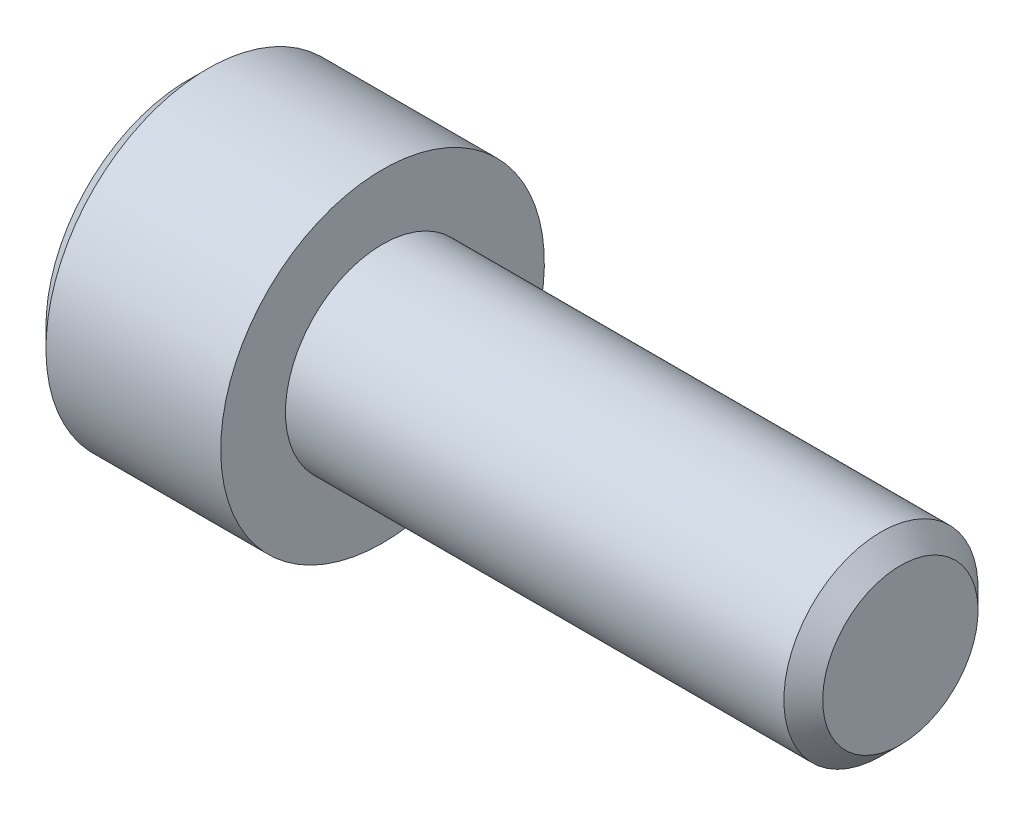
ISO-10303-21;
HEADER;
FILE_DESCRIPTION(('STEP AP214'),'2;1');
FILE_NAME('part.step','',(''),(''),'','','');
FILE_SCHEMA(('AUTOMOTIVE_DESIGN { 1 0 10303 214 1 1 1 1 }'));
ENDSEC;
DATA;
#1=APPLICATION_CONTEXT('core data for automotive mechanical design processes');
#2=APPLICATION_PROTOCOL_DEFINITION('international standard','automotive_design',2000,#1);
#3=PRODUCT_CONTEXT('',#1,'mechanical');
#4=PRODUCT('Part','Part','',(#3));
#5=PRODUCT_RELATED_PRODUCT_CATEGORY('part','',(#4));
#6=PRODUCT_DEFINITION_FORMATION('','',#4);
#7=PRODUCT_DEFINITION_CONTEXT('part definition',#1,'design');
#8=PRODUCT_DEFINITION('design','',#6,#7);
#9=PRODUCT_DEFINITION_SHAPE('','',#8);
#10=(LENGTH_UNIT() NAMED_UNIT(*) SI_UNIT(.MILLI.,.METRE.));
#11=(NAMED_UNIT(*) PLANE_ANGLE_UNIT() SI_UNIT($,.RADIAN.));
#12=(NAMED_UNIT(*) SI_UNIT($,.STERADIAN.) SOLID_ANGLE_UNIT());
#13=UNCERTAINTY_MEASURE_WITH_UNIT(LENGTH_MEASURE(1.E-05),#10,'distance_accuracy_value','');
#14=(GEOMETRIC_REPRESENTATION_CONTEXT(3) GLOBAL_UNCERTAINTY_ASSIGNED_CONTEXT((#13)) GLOBAL_UNIT_ASSIGNED_CONTEXT((#10,
#11,#12)) REPRESENTATION_CONTEXT('',''));
#15=CARTESIAN_POINT('',(0.,0.,0.));
#16=DIRECTION('',(0.,0.,1.));
#17=DIRECTION('',(1.,0.,0.));
#18=AXIS2_PLACEMENT_3D('',#15,#16,#17);
#19=CARTESIAN_POINT('',(-6.,0.,0.));
#20=DIRECTION('',(1.,0.,0.));
#21=DIRECTION('',(0.,1.,0.));
#22=AXIS2_PLACEMENT_3D('',#19,#20,#21);
#23=PLANE('',#22);
#24=CARTESIAN_POINT('',(-6.,0.,0.));
#25=DIRECTION('',(-1.,0.,0.));
#26=DIRECTION('',(0.,-1.,0.));
#27=AXIS2_PLACEMENT_3D('',#24,#25,#26);
#28=CIRCLE('',#27,4.4);
#29=CARTESIAN_POINT('',(-6.,-4.4,0.));
#30=VERTEX_POINT('',#29);
#31=EDGE_CURVE('E156',#30,#30,#28,.T.);
#32=ORIENTED_EDGE('',*,*,#31,.T.);
#33=EDGE_LOOP('',(#32));
#34=FACE_BOUND('',#33,.T.);
#35=DIRECTION('',(0.,-0.499999999999983,-0.866025403784448));
#36=VECTOR('',#35,1.);
#37=CARTESIAN_POINT('',(-6.,-1.4433756729741,2.5));
#38=LINE('',#37,#36);
#39=CARTESIAN_POINT('',(-6.,-1.4433756729741,2.5));
#40=VERTEX_POINT('',#39);
#41=CARTESIAN_POINT('',(-6.,-2.8867513459481,0.));
#42=VERTEX_POINT('',#41);
#43=EDGE_CURVE('E272',#40,#42,#38,.T.);
#44=ORIENTED_EDGE('',*,*,#43,.T.);
#45=DIRECTION('',(0.,0.499999999999983,-0.866025403784448));
#46=VECTOR('',#45,1.);
#47=CARTESIAN_POINT('',(-6.,-2.8867513459481,0.));
#48=LINE('',#47,#46);
#49=CARTESIAN_POINT('',(-6.,-1.4433756729741,-2.5));
#50=VERTEX_POINT('',#49);
#51=EDGE_CURVE('E274',#42,#50,#48,.T.);
#52=ORIENTED_EDGE('',*,*,#51,.T.);
#53=DIRECTION('',(0.,1.,0.));
#54=VECTOR('',#53,1.);
#55=CARTESIAN_POINT('',(-6.,-1.4433756729741,-2.5));
#56=LINE('',#55,#54);
#57=CARTESIAN_POINT('',(-6.,1.4433756729741,-2.5));
#58=VERTEX_POINT('',#57);
#59=EDGE_CURVE('E276',#50,#58,#56,.T.);
#60=ORIENTED_EDGE('',*,*,#59,.T.);
#61=DIRECTION('',(0.,0.499999999999983,0.866025403784448));
#62=VECTOR('',#61,1.);
#63=CARTESIAN_POINT('',(-6.,1.4433756729741,-2.5));
#64=LINE('',#63,#62);
#65=CARTESIAN_POINT('',(-6.,2.8867513459481,0.));
#66=VERTEX_POINT('',#65);
#67=EDGE_CURVE('E121',#58,#66,#64,.T.);
#68=ORIENTED_EDGE('',*,*,#67,.T.);
#69=DIRECTION('',(0.,-0.499999999999983,0.866025403784448));
#70=VECTOR('',#69,1.);
#71=CARTESIAN_POINT('',(-6.,2.8867513459481,0.));
#72=LINE('',#71,#70);
#73=CARTESIAN_POINT('',(-6.,1.4433756729741,2.5));
#74=VERTEX_POINT('',#73);
#75=EDGE_CURVE('E269',#66,#74,#72,.T.);
#76=ORIENTED_EDGE('',*,*,#75,.T.);
#77=DIRECTION('',(0.,-1.,0.));
#78=VECTOR('',#77,1.);
#79=CARTESIAN_POINT('',(-6.,1.4433756729741,2.5));
#80=LINE('',#79,#78);
#81=EDGE_CURVE('E136',#74,#40,#80,.T.);
#82=ORIENTED_EDGE('',*,*,#81,.T.);
#83=EDGE_LOOP('',(#44,#52,#60,#68,#76,#82));
#84=FACE_BOUND('',#83,.T.);
#85=ADVANCED_FACE('F37',(#34,#84),#23,.F.);
#86=CARTESIAN_POINT('',(-5.4,0.,0.));
#87=DIRECTION('',(1.,0.,0.));
#88=DIRECTION('',(0.,1.,0.));
#89=AXIS2_PLACEMENT_3D('',#86,#87,#88);
#90=CONICAL_SURFACE('',#89,5.,0.785398163397451);
#91=ORIENTED_EDGE('',*,*,#31,.F.);
#92=EDGE_LOOP('',(#91));
#93=FACE_BOUND('',#92,.T.);
#94=CARTESIAN_POINT('',(-5.4,0.,0.));
#95=DIRECTION('',(-1.,0.,0.));
#96=DIRECTION('',(0.,-1.,0.));
#97=AXIS2_PLACEMENT_3D('',#94,#95,#96);
#98=CIRCLE('',#97,5.);
#99=CARTESIAN_POINT('',(-5.4,-5.,0.));
#100=VERTEX_POINT('',#99);
#101=EDGE_CURVE('E153',#100,#100,#98,.T.);
#102=ORIENTED_EDGE('',*,*,#101,.T.);
#103=EDGE_LOOP('',(#102));
#104=FACE_BOUND('',#103,.T.);
#105=ADVANCED_FACE('F176',(#93,#104),#90,.T.);
#106=CARTESIAN_POINT('',(16.,0.,0.));
#107=DIRECTION('',(-1.,0.,0.));
#108=DIRECTION('',(0.,-1.,0.));
#109=AXIS2_PLACEMENT_3D('',#106,#107,#108);
#110=CYLINDRICAL_SURFACE('',#109,5.);
#111=ORIENTED_EDGE('',*,*,#101,.F.);
#112=EDGE_LOOP('',(#111));
#113=FACE_BOUND('',#112,.T.);
#114=CARTESIAN_POINT('',(0.,0.,0.));
#115=DIRECTION('',(-1.,0.,0.));
#116=DIRECTION('',(0.,-1.,0.));
#117=AXIS2_PLACEMENT_3D('',#114,#115,#116);
#118=CIRCLE('',#117,5.);
#119=CARTESIAN_POINT('',(0.,-5.,0.));
#120=VERTEX_POINT('',#119);
#121=EDGE_CURVE('E150',#120,#120,#118,.T.);
#122=ORIENTED_EDGE('',*,*,#121,.T.);
#123=EDGE_LOOP('',(#122));
#124=FACE_BOUND('',#123,.T.);
#125=ADVANCED_FACE('F181',(#113,#124),#110,.T.);
#126=CARTESIAN_POINT('',(0.,5.,0.));
#127=DIRECTION('',(-1.,0.,0.));
#128=DIRECTION('',(0.,-1.,0.));
#129=AXIS2_PLACEMENT_3D('',#126,#127,#128);
#130=PLANE('',#129);
#131=ORIENTED_EDGE('',*,*,#121,.F.);
#132=EDGE_LOOP('',(#131));
#133=FACE_BOUND('',#132,.T.);
#134=CARTESIAN_POINT('',(0.,0.,0.));
#135=DIRECTION('',(-1.,0.,0.));
#136=DIRECTION('',(0.,-1.,0.));
#137=AXIS2_PLACEMENT_3D('',#134,#135,#136);
#138=CIRCLE('',#137,3.);
#139=CARTESIAN_POINT('',(0.,-3.,0.));
#140=VERTEX_POINT('',#139);
#141=EDGE_CURVE('E146',#140,#140,#138,.T.);
#142=ORIENTED_EDGE('',*,*,#141,.T.);
#143=EDGE_LOOP('',(#142));
#144=FACE_BOUND('',#143,.T.);
#145=ADVANCED_FACE('F188',(#133,#144),#130,.F.);
#146=CARTESIAN_POINT('',(16.,0.,0.));
#147=DIRECTION('',(-1.,0.,0.));
#148=DIRECTION('',(0.,-1.,0.));
#149=AXIS2_PLACEMENT_3D('',#146,#147,#148);
#150=CYLINDRICAL_SURFACE('',#149,3.);
#151=CARTESIAN_POINT('',(15.4,0.,0.));
#152=DIRECTION('',(-1.,0.,0.));
#153=DIRECTION('',(0.,-1.,0.));
#154=AXIS2_PLACEMENT_3D('',#151,#152,#153);
#155=CIRCLE('',#154,3.);
#156=CARTESIAN_POINT('',(15.4,-3.,0.));
#157=VERTEX_POINT('',#156);
#158=EDGE_CURVE('E45',#157,#157,#155,.T.);
#159=ORIENTED_EDGE('',*,*,#158,.T.);
#160=EDGE_LOOP('',(#159));
#161=FACE_BOUND('',#160,.T.);
#162=ORIENTED_EDGE('',*,*,#141,.F.);
#163=EDGE_LOOP('',(#162));
#164=FACE_BOUND('',#163,.T.);
#165=ADVANCED_FACE('F161',(#161,#164),#150,.T.);
#166=CARTESIAN_POINT('',(16.,3.,0.));
#167=DIRECTION('',(-1.,0.,0.));
#168=DIRECTION('',(0.,-1.,0.));
#169=AXIS2_PLACEMENT_3D('',#166,#167,#168);
#170=PLANE('',#169);
#171=CARTESIAN_POINT('',(16.,0.,0.));
#172=DIRECTION('',(-1.,0.,0.));
#173=DIRECTION('',(0.,-1.,0.));
#174=AXIS2_PLACEMENT_3D('',#171,#172,#173);
#175=CIRCLE('',#174,2.39999999999999);
#176=CARTESIAN_POINT('',(16.,-2.39999999999999,0.));
#177=VERTEX_POINT('',#176);
#178=EDGE_CURVE('E11',#177,#177,#175,.F.);
#179=ORIENTED_EDGE('',*,*,#178,.T.);
#180=EDGE_LOOP('',(#179));
#181=FACE_BOUND('',#180,.T.);
#182=ADVANCED_FACE('F165',(#181),#170,.F.);
#183=CARTESIAN_POINT('',(15.4,0.,0.));
#184=DIRECTION('',(-1.,0.,0.));
#185=DIRECTION('',(0.,-1.,0.));
#186=AXIS2_PLACEMENT_3D('',#183,#184,#185);
#187=CONICAL_SURFACE('',#186,3.,0.785398163397455);
#188=ORIENTED_EDGE('',*,*,#178,.F.);
#189=EDGE_LOOP('',(#188));
#190=FACE_BOUND('',#189,.T.);
#191=ORIENTED_EDGE('',*,*,#158,.F.);
#192=EDGE_LOOP('',(#191));
#193=FACE_BOUND('',#192,.T.);
#194=ADVANCED_FACE('F39',(#190,#193),#187,.T.);
#195=CARTESIAN_POINT('',(-3.,2.8867513459481,0.));
#196=DIRECTION('',(0.,-0.866025403784448,-0.499999999999983));
#197=DIRECTION('',(0.,0.499999999999983,-0.866025403784448));
#198=AXIS2_PLACEMENT_3D('',#195,#196,#197);
#199=PLANE('',#198);
#200=DIRECTION('',(0.,-0.499999999999983,0.866025403784448));
#201=VECTOR('',#200,1.);
#202=CARTESIAN_POINT('',(-3.,2.8867513459481,0.));
#203=LINE('',#202,#201);
#204=CARTESIAN_POINT('',(-3.,2.8867513459481,0.));
#205=VERTEX_POINT('',#204);
#206=CARTESIAN_POINT('',(-3.,2.16506350946112,1.24999999999996));
#207=VERTEX_POINT('',#206);
#208=EDGE_CURVE('E118',#205,#207,#203,.T.);
#209=ORIENTED_EDGE('',*,*,#208,.T.);
#210=CARTESIAN_POINT('',(-3.,1.4433756729741,2.5));
#211=VERTEX_POINT('',#210);
#212=EDGE_CURVE('E110',#207,#211,#203,.T.);
#213=ORIENTED_EDGE('',*,*,#212,.T.);
#214=DIRECTION('',(-1.,0.,0.));
#215=VECTOR('',#214,1.);
#216=CARTESIAN_POINT('',(-3.,1.4433756729741,2.5));
#217=LINE('',#216,#215);
#218=EDGE_CURVE('E115',#211,#74,#217,.T.);
#219=ORIENTED_EDGE('',*,*,#218,.T.);
#220=ORIENTED_EDGE('',*,*,#75,.F.);
#221=DIRECTION('',(-1.,0.,0.));
#222=VECTOR('',#221,1.);
#223=CARTESIAN_POINT('',(-3.,2.8867513459481,0.));
#224=LINE('',#223,#222);
#225=EDGE_CURVE('E253',#205,#66,#224,.T.);
#226=ORIENTED_EDGE('',*,*,#225,.F.);
#227=EDGE_LOOP('',(#209,#213,#219,#220,#226));
#228=FACE_BOUND('',#227,.T.);
#229=ADVANCED_FACE('F112',(#228),#199,.T.);
#230=CARTESIAN_POINT('',(-3.,1.4433756729741,2.5));
#231=DIRECTION('',(0.,0.,-1.));
#232=DIRECTION('',(-1.,0.,0.));
#233=AXIS2_PLACEMENT_3D('',#230,#231,#232);
#234=PLANE('',#233);
#235=DIRECTION('',(0.,-1.,0.));
#236=VECTOR('',#235,1.);
#237=CARTESIAN_POINT('',(-3.,1.4433756729741,2.5));
#238=LINE('',#237,#236);
#239=CARTESIAN_POINT('',(-3.,0.,2.5));
#240=VERTEX_POINT('',#239);
#241=EDGE_CURVE('E124',#211,#240,#238,.T.);
#242=ORIENTED_EDGE('',*,*,#241,.T.);
#243=CARTESIAN_POINT('',(-3.,-1.4433756729741,2.5));
#244=VERTEX_POINT('',#243);
#245=EDGE_CURVE('E131',#240,#244,#238,.T.);
#246=ORIENTED_EDGE('',*,*,#245,.T.);
#247=DIRECTION('',(-1.,0.,0.));
#248=VECTOR('',#247,1.);
#249=CARTESIAN_POINT('',(-3.,-1.4433756729741,2.5));
#250=LINE('',#249,#248);
#251=EDGE_CURVE('E138',#244,#40,#250,.T.);
#252=ORIENTED_EDGE('',*,*,#251,.T.);
#253=ORIENTED_EDGE('',*,*,#81,.F.);
#254=ORIENTED_EDGE('',*,*,#218,.F.);
#255=EDGE_LOOP('',(#242,#246,#252,#253,#254));
#256=FACE_BOUND('',#255,.T.);
#257=ADVANCED_FACE('F134',(#256),#234,.T.);
#258=CARTESIAN_POINT('',(-3.,-1.4433756729741,2.5));
#259=DIRECTION('',(0.,0.866025403784448,-0.499999999999983));
#260=DIRECTION('',(0.,0.499999999999983,0.866025403784448));
#261=AXIS2_PLACEMENT_3D('',#258,#259,#260);
#262=PLANE('',#261);
#263=DIRECTION('',(0.,-0.499999999999983,-0.866025403784448));
#264=VECTOR('',#263,1.);
#265=CARTESIAN_POINT('',(-3.,-1.4433756729741,2.5));
#266=LINE('',#265,#264);
#267=CARTESIAN_POINT('',(-3.,-2.16506350946112,1.24999999999996));
#268=VERTEX_POINT('',#267);
#269=EDGE_CURVE('E260',#244,#268,#266,.T.);
#270=ORIENTED_EDGE('',*,*,#269,.T.);
#271=CARTESIAN_POINT('',(-3.,-2.8867513459481,0.));
#272=VERTEX_POINT('',#271);
#273=EDGE_CURVE('E130',#268,#272,#266,.T.);
#274=ORIENTED_EDGE('',*,*,#273,.T.);
#275=DIRECTION('',(-1.,0.,0.));
#276=VECTOR('',#275,1.);
#277=CARTESIAN_POINT('',(-3.,-2.8867513459481,0.));
#278=LINE('',#277,#276);
#279=EDGE_CURVE('E142',#272,#42,#278,.T.);
#280=ORIENTED_EDGE('',*,*,#279,.T.);
#281=ORIENTED_EDGE('',*,*,#43,.F.);
#282=ORIENTED_EDGE('',*,*,#251,.F.);
#283=EDGE_LOOP('',(#270,#274,#280,#281,#282));
#284=FACE_BOUND('',#283,.T.);
#285=ADVANCED_FACE('F202',(#284),#262,.T.);
#286=CARTESIAN_POINT('',(-3.,-2.8867513459481,0.));
#287=DIRECTION('',(0.,0.866025403784448,0.499999999999983));
#288=DIRECTION('',(0.,-0.499999999999983,0.866025403784448));
#289=AXIS2_PLACEMENT_3D('',#286,#287,#288);
#290=PLANE('',#289);
#291=DIRECTION('',(0.,0.499999999999983,-0.866025403784448));
#292=VECTOR('',#291,1.);
#293=CARTESIAN_POINT('',(-3.,-2.8867513459481,0.));
#294=LINE('',#293,#292);
#295=CARTESIAN_POINT('',(-3.,-2.16506350946112,-1.24999999999996));
#296=VERTEX_POINT('',#295);
#297=EDGE_CURVE('E52',#272,#296,#294,.T.);
#298=ORIENTED_EDGE('',*,*,#297,.T.);
#299=CARTESIAN_POINT('',(-3.,-1.4433756729741,-2.5));
#300=VERTEX_POINT('',#299);
#301=EDGE_CURVE('E265',#296,#300,#294,.T.);
#302=ORIENTED_EDGE('',*,*,#301,.T.);
#303=DIRECTION('',(-1.,0.,0.));
#304=VECTOR('',#303,1.);
#305=CARTESIAN_POINT('',(-3.,-1.4433756729741,-2.5));
#306=LINE('',#305,#304);
#307=EDGE_CURVE('E281',#300,#50,#306,.T.);
#308=ORIENTED_EDGE('',*,*,#307,.T.);
#309=ORIENTED_EDGE('',*,*,#51,.F.);
#310=ORIENTED_EDGE('',*,*,#279,.F.);
#311=EDGE_LOOP('',(#298,#302,#308,#309,#310));
#312=FACE_BOUND('',#311,.T.);
#313=ADVANCED_FACE('F205',(#312),#290,.T.);
#314=CARTESIAN_POINT('',(-3.,-1.4433756729741,-2.5));
#315=DIRECTION('',(0.,0.,1.));
#316=DIRECTION('',(1.,0.,0.));
#317=AXIS2_PLACEMENT_3D('',#314,#315,#316);
#318=PLANE('',#317);
#319=DIRECTION('',(0.,1.,0.));
#320=VECTOR('',#319,1.);
#321=CARTESIAN_POINT('',(-3.,-1.4433756729741,-2.5));
#322=LINE('',#321,#320);
#323=CARTESIAN_POINT('',(-3.,0.,-2.5));
#324=VERTEX_POINT('',#323);
#325=EDGE_CURVE('E247',#300,#324,#322,.T.);
#326=ORIENTED_EDGE('',*,*,#325,.T.);
#327=CARTESIAN_POINT('',(-3.,1.4433756729741,-2.5));
#328=VERTEX_POINT('',#327);
#329=EDGE_CURVE('E240',#324,#328,#322,.T.);
#330=ORIENTED_EDGE('',*,*,#329,.T.);
#331=DIRECTION('',(-1.,0.,0.));
#332=VECTOR('',#331,1.);
#333=CARTESIAN_POINT('',(-3.,1.4433756729741,-2.5));
#334=LINE('',#333,#332);
#335=EDGE_CURVE('E252',#328,#58,#334,.T.);
#336=ORIENTED_EDGE('',*,*,#335,.T.);
#337=ORIENTED_EDGE('',*,*,#59,.F.);
#338=ORIENTED_EDGE('',*,*,#307,.F.);
#339=EDGE_LOOP('',(#326,#330,#336,#337,#338));
#340=FACE_BOUND('',#339,.T.);
#341=ADVANCED_FACE('F209',(#340),#318,.T.);
#342=CARTESIAN_POINT('',(-3.,1.4433756729741,-2.5));
#343=DIRECTION('',(0.,-0.866025403784448,0.499999999999983));
#344=DIRECTION('',(0.,-0.499999999999983,-0.866025403784448));
#345=AXIS2_PLACEMENT_3D('',#342,#343,#344);
#346=PLANE('',#345);
#347=DIRECTION('',(0.,0.499999999999983,0.866025403784448));
#348=VECTOR('',#347,1.);
#349=CARTESIAN_POINT('',(-3.,1.4433756729741,-2.5));
#350=LINE('',#349,#348);
#351=CARTESIAN_POINT('',(-3.,2.16506350946112,-1.24999999999996));
#352=VERTEX_POINT('',#351);
#353=EDGE_CURVE('E239',#328,#352,#350,.T.);
#354=ORIENTED_EDGE('',*,*,#353,.T.);
#355=EDGE_CURVE('E245',#352,#205,#350,.T.);
#356=ORIENTED_EDGE('',*,*,#355,.T.);
#357=ORIENTED_EDGE('',*,*,#225,.T.);
#358=ORIENTED_EDGE('',*,*,#67,.F.);
#359=ORIENTED_EDGE('',*,*,#335,.F.);
#360=EDGE_LOOP('',(#354,#356,#357,#358,#359));
#361=FACE_BOUND('',#360,.T.);
#362=ADVANCED_FACE('F212',(#361),#346,.T.);
#363=CARTESIAN_POINT('',(-3.,1.4433756729741,2.5));
#364=DIRECTION('',(1.,0.,0.));
#365=DIRECTION('',(0.,0.,-1.));
#366=AXIS2_PLACEMENT_3D('',#363,#364,#365);
#367=PLANE('',#366);
#368=CARTESIAN_POINT('',(-3.,0.,0.));
#369=DIRECTION('',(-1.,0.,0.));
#370=DIRECTION('',(0.,0.,1.));
#371=AXIS2_PLACEMENT_3D('',#368,#369,#370);
#372=CIRCLE('',#371,2.5);
#373=EDGE_CURVE('E236',#352,#324,#372,.T.);
#374=ORIENTED_EDGE('',*,*,#373,.F.);
#375=ORIENTED_EDGE('',*,*,#353,.F.);
#376=ORIENTED_EDGE('',*,*,#329,.F.);
#377=EDGE_LOOP('',(#374,#375,#376));
#378=FACE_BOUND('',#377,.T.);
#379=ADVANCED_FACE('F216',(#378),#367,.F.);
#380=EDGE_CURVE('E147',#207,#352,#372,.T.);
#381=ORIENTED_EDGE('',*,*,#380,.F.);
#382=ORIENTED_EDGE('',*,*,#208,.F.);
#383=ORIENTED_EDGE('',*,*,#355,.F.);
#384=EDGE_LOOP('',(#381,#382,#383));
#385=FACE_BOUND('',#384,.T.);
#386=ADVANCED_FACE('F227',(#385),#367,.F.);
#387=EDGE_CURVE('E126',#240,#207,#372,.T.);
#388=ORIENTED_EDGE('',*,*,#387,.F.);
#389=ORIENTED_EDGE('',*,*,#241,.F.);
#390=ORIENTED_EDGE('',*,*,#212,.F.);
#391=EDGE_LOOP('',(#388,#389,#390));
#392=FACE_BOUND('',#391,.T.);
#393=ADVANCED_FACE('F125',(#392),#367,.F.);
#394=EDGE_CURVE('E137',#268,#240,#372,.T.);
#395=ORIENTED_EDGE('',*,*,#394,.F.);
#396=ORIENTED_EDGE('',*,*,#269,.F.);
#397=ORIENTED_EDGE('',*,*,#245,.F.);
#398=EDGE_LOOP('',(#395,#396,#397));
#399=FACE_BOUND('',#398,.T.);
#400=ADVANCED_FACE('F224',(#399),#367,.F.);
#401=EDGE_CURVE('E140',#296,#268,#372,.T.);
#402=ORIENTED_EDGE('',*,*,#401,.F.);
#403=ORIENTED_EDGE('',*,*,#297,.F.);
#404=ORIENTED_EDGE('',*,*,#273,.F.);
#405=EDGE_LOOP('',(#402,#403,#404));
#406=FACE_BOUND('',#405,.T.);
#407=ADVANCED_FACE('F219',(#406),#367,.F.);
#408=EDGE_CURVE('E244',#324,#296,#372,.T.);
#409=ORIENTED_EDGE('',*,*,#408,.F.);
#410=ORIENTED_EDGE('',*,*,#325,.F.);
#411=ORIENTED_EDGE('',*,*,#301,.F.);
#412=EDGE_LOOP('',(#409,#410,#411));
#413=FACE_BOUND('',#412,.T.);
#414=ADVANCED_FACE('F197',(#413),#367,.F.);
#415=CARTESIAN_POINT('',(-2.3301270189222,0.,0.));
#416=DIRECTION('',(-1.,0.,0.));
#417=DIRECTION('',(0.,0.,1.));
#418=AXIS2_PLACEMENT_3D('',#415,#416,#417);
#419=CONICAL_SURFACE('',#418,0.,1.30899693899575);
#420=ORIENTED_EDGE('',*,*,#387,.T.);
#421=ORIENTED_EDGE('',*,*,#380,.T.);
#422=ORIENTED_EDGE('',*,*,#373,.T.);
#423=ORIENTED_EDGE('',*,*,#408,.T.);
#424=ORIENTED_EDGE('',*,*,#401,.T.);
#425=ORIENTED_EDGE('',*,*,#394,.T.);
#426=EDGE_LOOP('',(#420,#421,#422,#423,#424,#425));
#427=FACE_BOUND('',#426,.T.);
#428=CARTESIAN_POINT('',(-2.3301270189222,0.,0.));
#429=VERTEX_POINT('',#428);
#430=VERTEX_LOOP('',#429);
#431=FACE_BOUND('',#430,.T.);
#432=ADVANCED_FACE('F195',(#427,#431),#419,.F.);
#433=CLOSED_SHELL('',(#85,#105,#125,#145,#165,#182,#194,#229,#257,#285,#313,#341,#362,#379,#386,
#393,#400,#407,#414,#432));
#434=MANIFOLD_SOLID_BREP('B2',#433);
#435=ADVANCED_BREP_SHAPE_REPRESENTATION('',(#18,#434),#14);
#436=SHAPE_DEFINITION_REPRESENTATION(#9,#435);
ENDSEC;
END-ISO-10303-21;
